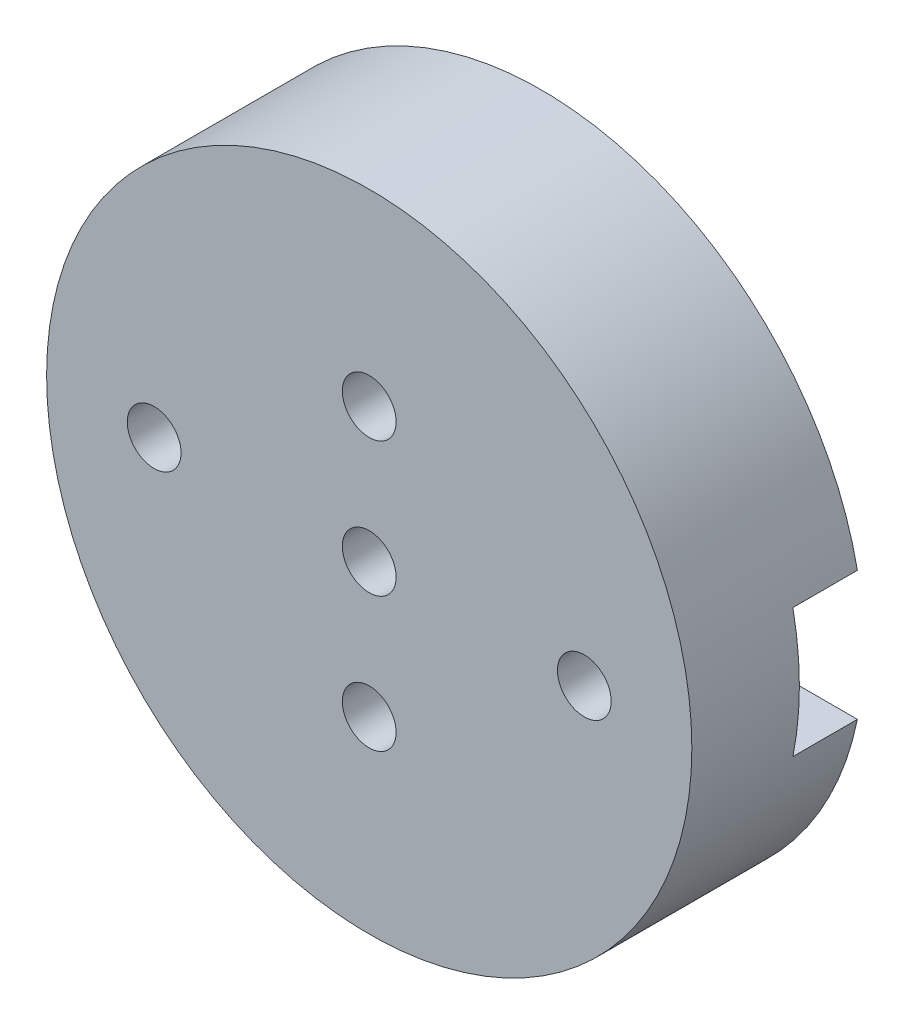
ISO-10303-21;
HEADER;
FILE_DESCRIPTION(('STEP AP214'),'2;1');
FILE_NAME('part.step','',(''),(''),'','','');
FILE_SCHEMA(('AUTOMOTIVE_DESIGN { 1 0 10303 214 1 1 1 1 }'));
ENDSEC;
DATA;
#1=APPLICATION_CONTEXT('core data for automotive mechanical design processes');
#2=APPLICATION_PROTOCOL_DEFINITION('international standard','automotive_design',2000,#1);
#3=PRODUCT_CONTEXT('',#1,'mechanical');
#4=PRODUCT('Part','Part','',(#3));
#5=PRODUCT_RELATED_PRODUCT_CATEGORY('part','',(#4));
#6=PRODUCT_DEFINITION_FORMATION('','',#4);
#7=PRODUCT_DEFINITION_CONTEXT('part definition',#1,'design');
#8=PRODUCT_DEFINITION('design','',#6,#7);
#9=PRODUCT_DEFINITION_SHAPE('','',#8);
#10=(LENGTH_UNIT() NAMED_UNIT(*) SI_UNIT(.MILLI.,.METRE.));
#11=(NAMED_UNIT(*) PLANE_ANGLE_UNIT() SI_UNIT($,.RADIAN.));
#12=(NAMED_UNIT(*) SI_UNIT($,.STERADIAN.) SOLID_ANGLE_UNIT());
#13=UNCERTAINTY_MEASURE_WITH_UNIT(LENGTH_MEASURE(1.E-05),#10,'distance_accuracy_value','');
#14=(GEOMETRIC_REPRESENTATION_CONTEXT(3) GLOBAL_UNCERTAINTY_ASSIGNED_CONTEXT((#13)) GLOBAL_UNIT_ASSIGNED_CONTEXT((#10,
#11,#12)) REPRESENTATION_CONTEXT('',''));
#15=CARTESIAN_POINT('',(0.,0.,0.));
#16=DIRECTION('',(0.,0.,1.));
#17=DIRECTION('',(1.,0.,0.));
#18=AXIS2_PLACEMENT_3D('',#15,#16,#17);
#19=CARTESIAN_POINT('',(0.,0.,0.));
#20=DIRECTION('',(0.,0.,1.));
#21=DIRECTION('',(1.,0.,0.));
#22=AXIS2_PLACEMENT_3D('',#19,#20,#21);
#23=PLANE('',#22);
#24=CARTESIAN_POINT('',(0.,6.52256026967279E-13,0.));
#25=DIRECTION('',(0.,0.,1.));
#26=DIRECTION('',(1.,0.,0.));
#27=AXIS2_PLACEMENT_3D('',#24,#25,#26);
#28=CIRCLE('',#27,43.1561541031372);
#29=CARTESIAN_POINT('',(21.6669859204082,-37.3228530273144,0.));
#30=VERTEX_POINT('',#29);
#31=CARTESIAN_POINT('',(-21.4890459031632,-37.4255867441704,0.));
#32=VERTEX_POINT('',#31);
#33=EDGE_CURVE('E221',#30,#32,#28,.F.);
#34=ORIENTED_EDGE('',*,*,#33,.T.);
#35=CARTESIAN_POINT('',(-24.476667902817,-42.6288659781905,0.));
#36=DIRECTION('',(0.,0.,1.));
#37=DIRECTION('',(1.,0.,0.));
#38=AXIS2_PLACEMENT_3D('',#35,#36,#37);
#39=CIRCLE('',#38,6.00000000000001);
#40=CARTESIAN_POINT('',(-27.4642899024707,-47.8321452122106,0.));
#41=VERTEX_POINT('',#40);
#42=EDGE_CURVE('E56',#41,#32,#39,.F.);
#43=ORIENTED_EDGE('',*,*,#42,.F.);
#44=CARTESIAN_POINT('',(0.,6.52256026967279E-13,0.));
#45=DIRECTION('',(0.,0.,1.));
#46=DIRECTION('',(1.,0.,0.));
#47=AXIS2_PLACEMENT_3D('',#44,#45,#46);
#48=CIRCLE('',#47,55.1561541031372);
#49=CARTESIAN_POINT('',(27.6917079200453,-47.7008453585453,0.));
#50=VERTEX_POINT('',#49);
#51=EDGE_CURVE('E235',#50,#41,#48,.F.);
#52=ORIENTED_EDGE('',*,*,#51,.F.);
#53=CARTESIAN_POINT('',(24.6793469202267,-42.5118491929299,0.));
#54=DIRECTION('',(0.,0.,1.));
#55=DIRECTION('',(1.,0.,0.));
#56=AXIS2_PLACEMENT_3D('',#53,#54,#55);
#57=CIRCLE('',#56,6.00000000000001);
#58=EDGE_CURVE('E239',#30,#50,#57,.F.);
#59=ORIENTED_EDGE('',*,*,#58,.F.);
#60=EDGE_LOOP('',(#34,#43,#52,#59));
#61=FACE_BOUND('',#60,.T.);
#62=DIRECTION('',(1.,0.,0.));
#63=VECTOR('',#62,1.);
#64=CARTESIAN_POINT('',(0.,-12.,0.));
#65=LINE('',#64,#63);
#66=CARTESIAN_POINT('',(12.0000000000004,-12.,0.));
#67=VERTEX_POINT('',#66);
#68=CARTESIAN_POINT('',(58.7877538267963,-12.,0.));
#69=VERTEX_POINT('',#68);
#70=EDGE_CURVE('E301',#67,#69,#65,.T.);
#71=ORIENTED_EDGE('',*,*,#70,.T.);
#72=CARTESIAN_POINT('',(0.,0.,0.));
#73=DIRECTION('',(0.,0.,1.));
#74=DIRECTION('',(1.,0.,0.));
#75=AXIS2_PLACEMENT_3D('',#72,#73,#74);
#76=CIRCLE('',#75,60.);
#77=CARTESIAN_POINT('',(-58.7877538267963,-12.,0.));
#78=VERTEX_POINT('',#77);
#79=EDGE_CURVE('E393',#78,#69,#76,.T.);
#80=ORIENTED_EDGE('',*,*,#79,.F.);
#81=DIRECTION('',(1.,0.,0.));
#82=VECTOR('',#81,1.);
#83=CARTESIAN_POINT('',(0.,-12.,0.));
#84=LINE('',#83,#82);
#85=CARTESIAN_POINT('',(-12.,-12.,0.));
#86=VERTEX_POINT('',#85);
#87=EDGE_CURVE('E262',#78,#86,#84,.T.);
#88=ORIENTED_EDGE('',*,*,#87,.T.);
#89=DIRECTION('',(0.,-1.,0.));
#90=VECTOR('',#89,1.);
#91=CARTESIAN_POINT('',(-12.,0.,0.));
#92=LINE('',#91,#90);
#93=CARTESIAN_POINT('',(-12.,-25.,0.));
#94=VERTEX_POINT('',#93);
#95=EDGE_CURVE('E203',#86,#94,#92,.T.);
#96=ORIENTED_EDGE('',*,*,#95,.T.);
#97=CARTESIAN_POINT('',(2.60330291914301E-13,-25.,0.));
#98=DIRECTION('',(0.,0.,1.));
#99=DIRECTION('',(1.,0.,0.));
#100=AXIS2_PLACEMENT_3D('',#97,#98,#99);
#101=CIRCLE('',#100,12.);
#102=CARTESIAN_POINT('',(12.,-25.,0.));
#103=VERTEX_POINT('',#102);
#104=EDGE_CURVE('E210',#94,#103,#101,.T.);
#105=ORIENTED_EDGE('',*,*,#104,.T.);
#106=DIRECTION('',(0.,-1.,0.));
#107=VECTOR('',#106,1.);
#108=CARTESIAN_POINT('',(12.0000000000007,-3.50681022682102E-13,0.));
#109=LINE('',#108,#107);
#110=EDGE_CURVE('E297',#67,#103,#109,.T.);
#111=ORIENTED_EDGE('',*,*,#110,.F.);
#112=EDGE_LOOP('',(#71,#80,#88,#96,#105,#111));
#113=FACE_BOUND('',#112,.T.);
#114=ADVANCED_FACE('F40',(#61,#113),#23,.F.);
#115=CARTESIAN_POINT('',(0.,0.,32.));
#116=DIRECTION('',(0.,0.,-1.));
#117=DIRECTION('',(-1.,0.,0.));
#118=AXIS2_PLACEMENT_3D('',#115,#116,#117);
#119=CYLINDRICAL_SURFACE('',#118,60.);
#120=CARTESIAN_POINT('',(0.,0.,32.));
#121=DIRECTION('',(0.,0.,1.));
#122=DIRECTION('',(1.,0.,0.));
#123=AXIS2_PLACEMENT_3D('',#120,#121,#122);
#124=CIRCLE('',#123,60.);
#125=CARTESIAN_POINT('',(60.,0.,32.));
#126=VERTEX_POINT('',#125);
#127=EDGE_CURVE('E394',#126,#126,#124,.T.);
#128=ORIENTED_EDGE('',*,*,#127,.F.);
#129=EDGE_LOOP('',(#128));
#130=FACE_BOUND('',#129,.T.);
#131=CARTESIAN_POINT('',(58.7877538267963,12.,0.));
#132=VERTEX_POINT('',#131);
#133=CARTESIAN_POINT('',(-58.7877538267963,12.,0.));
#134=VERTEX_POINT('',#133);
#135=EDGE_CURVE('E399',#132,#134,#76,.T.);
#136=ORIENTED_EDGE('',*,*,#135,.T.);
#137=DIRECTION('',(0.,0.,-1.));
#138=VECTOR('',#137,1.);
#139=CARTESIAN_POINT('',(-58.7877538267963,12.,32.));
#140=LINE('',#139,#138);
#141=CARTESIAN_POINT('',(-58.7877538267963,12.,12.));
#142=VERTEX_POINT('',#141);
#143=EDGE_CURVE('E11',#134,#142,#140,.F.);
#144=ORIENTED_EDGE('',*,*,#143,.T.);
#145=CARTESIAN_POINT('',(0.,0.,12.));
#146=DIRECTION('',(0.,0.,1.));
#147=DIRECTION('',(1.,0.,0.));
#148=AXIS2_PLACEMENT_3D('',#145,#146,#147);
#149=CIRCLE('',#148,60.);
#150=CARTESIAN_POINT('',(-58.7877538267963,-12.,12.));
#151=VERTEX_POINT('',#150);
#152=EDGE_CURVE('E372',#142,#151,#149,.T.);
#153=ORIENTED_EDGE('',*,*,#152,.T.);
#154=DIRECTION('',(0.,0.,-1.));
#155=VECTOR('',#154,1.);
#156=CARTESIAN_POINT('',(-58.7877538267963,-12.,32.));
#157=LINE('',#156,#155);
#158=EDGE_CURVE('E49',#78,#151,#157,.F.);
#159=ORIENTED_EDGE('',*,*,#158,.F.);
#160=ORIENTED_EDGE('',*,*,#79,.T.);
#161=DIRECTION('',(0.,0.,-1.));
#162=VECTOR('',#161,1.);
#163=CARTESIAN_POINT('',(58.7877538267963,-12.,32.));
#164=LINE('',#163,#162);
#165=CARTESIAN_POINT('',(58.7877538267963,-12.,12.));
#166=VERTEX_POINT('',#165);
#167=EDGE_CURVE('E409',#166,#69,#164,.T.);
#168=ORIENTED_EDGE('',*,*,#167,.F.);
#169=CARTESIAN_POINT('',(58.7877538267963,12.,12.));
#170=VERTEX_POINT('',#169);
#171=EDGE_CURVE('E368',#166,#170,#149,.T.);
#172=ORIENTED_EDGE('',*,*,#171,.T.);
#173=DIRECTION('',(0.,0.,-1.));
#174=VECTOR('',#173,1.);
#175=CARTESIAN_POINT('',(58.7877538267963,12.,32.));
#176=LINE('',#175,#174);
#177=EDGE_CURVE('E398',#170,#132,#176,.T.);
#178=ORIENTED_EDGE('',*,*,#177,.T.);
#179=EDGE_LOOP('',(#136,#144,#153,#159,#160,#168,#172,#178));
#180=FACE_BOUND('',#179,.T.);
#181=ADVANCED_FACE('F42',(#130,#180),#119,.T.);
#182=CARTESIAN_POINT('',(0.,0.,32.));
#183=DIRECTION('',(0.,0.,1.));
#184=DIRECTION('',(1.,0.,0.));
#185=AXIS2_PLACEMENT_3D('',#182,#183,#184);
#186=PLANE('',#185);
#187=CARTESIAN_POINT('',(0.,25.,32.));
#188=DIRECTION('',(0.,0.,1.));
#189=DIRECTION('',(1.,0.,0.));
#190=AXIS2_PLACEMENT_3D('',#187,#188,#189);
#191=CIRCLE('',#190,5.);
#192=CARTESIAN_POINT('',(4.99999999999991,25.,32.));
#193=VERTEX_POINT('',#192);
#194=EDGE_CURVE('E377',#193,#193,#191,.T.);
#195=ORIENTED_EDGE('',*,*,#194,.F.);
#196=EDGE_LOOP('',(#195));
#197=FACE_BOUND('',#196,.T.);
#198=CARTESIAN_POINT('',(40.,0.,32.));
#199=DIRECTION('',(0.,0.,1.));
#200=DIRECTION('',(1.,0.,0.));
#201=AXIS2_PLACEMENT_3D('',#198,#199,#200);
#202=CIRCLE('',#201,5.);
#203=CARTESIAN_POINT('',(45.,0.,32.));
#204=VERTEX_POINT('',#203);
#205=EDGE_CURVE('E385',#204,#204,#202,.T.);
#206=ORIENTED_EDGE('',*,*,#205,.F.);
#207=EDGE_LOOP('',(#206));
#208=FACE_BOUND('',#207,.T.);
#209=ORIENTED_EDGE('',*,*,#127,.T.);
#210=EDGE_LOOP('',(#209));
#211=FACE_BOUND('',#210,.T.);
#212=CARTESIAN_POINT('',(0.,0.,32.));
#213=DIRECTION('',(0.,0.,1.));
#214=DIRECTION('',(1.,0.,0.));
#215=AXIS2_PLACEMENT_3D('',#212,#213,#214);
#216=CIRCLE('',#215,5.);
#217=CARTESIAN_POINT('',(5.,0.,32.));
#218=VERTEX_POINT('',#217);
#219=EDGE_CURVE('E389',#218,#218,#216,.T.);
#220=ORIENTED_EDGE('',*,*,#219,.F.);
#221=EDGE_LOOP('',(#220));
#222=FACE_BOUND('',#221,.T.);
#223=CARTESIAN_POINT('',(-40.,-2.79318507107451E-13,32.));
#224=DIRECTION('',(0.,0.,1.));
#225=DIRECTION('',(1.,0.,0.));
#226=AXIS2_PLACEMENT_3D('',#223,#224,#225);
#227=CIRCLE('',#226,5.);
#228=CARTESIAN_POINT('',(-35.,-2.79318507107451E-13,32.));
#229=VERTEX_POINT('',#228);
#230=EDGE_CURVE('E381',#229,#229,#227,.T.);
#231=ORIENTED_EDGE('',*,*,#230,.F.);
#232=EDGE_LOOP('',(#231));
#233=FACE_BOUND('',#232,.T.);
#234=CARTESIAN_POINT('',(2.60330291914301E-13,-25.,32.));
#235=DIRECTION('',(0.,0.,1.));
#236=DIRECTION('',(1.,0.,0.));
#237=AXIS2_PLACEMENT_3D('',#234,#235,#236);
#238=CIRCLE('',#237,5.);
#239=CARTESIAN_POINT('',(5.00000000000026,-25.,32.));
#240=VERTEX_POINT('',#239);
#241=EDGE_CURVE('E373',#240,#240,#238,.T.);
#242=ORIENTED_EDGE('',*,*,#241,.F.);
#243=EDGE_LOOP('',(#242));
#244=FACE_BOUND('',#243,.T.);
#245=ADVANCED_FACE('F506',(#197,#208,#211,#222,#233,#244),#186,.T.);
#246=CARTESIAN_POINT('',(0.,6.52256026967279E-13,0.));
#247=DIRECTION('',(0.,0.,1.));
#248=DIRECTION('',(1.,0.,0.));
#249=AXIS2_PLACEMENT_3D('',#246,#247,#248);
#250=CIRCLE('',#249,54.9999999999994);
#251=CARTESIAN_POINT('',(27.6133091650036,47.5657981848085,0.));
#252=VERTEX_POINT('',#251);
#253=CARTESIAN_POINT('',(-27.3865349968262,47.6967263118509,0.));
#254=VERTEX_POINT('',#253);
#255=EDGE_CURVE('E64',#252,#254,#250,.T.);
#256=ORIENTED_EDGE('',*,*,#255,.T.);
#257=CARTESIAN_POINT('',(-24.3989129971725,42.4934470778308,0.));
#258=DIRECTION('',(0.,0.,1.));
#259=DIRECTION('',(1.,0.,0.));
#260=AXIS2_PLACEMENT_3D('',#257,#258,#259);
#261=CIRCLE('',#260,6.);
#262=CARTESIAN_POINT('',(-21.4112909975187,37.2901678438107,0.));
#263=VERTEX_POINT('',#262);
#264=EDGE_CURVE('E201',#254,#263,#261,.T.);
#265=ORIENTED_EDGE('',*,*,#264,.T.);
#266=CARTESIAN_POINT('',(0.,6.52256026967279E-13,0.));
#267=DIRECTION('',(0.,0.,1.));
#268=DIRECTION('',(1.,0.,0.));
#269=AXIS2_PLACEMENT_3D('',#266,#267,#268);
#270=CIRCLE('',#269,42.9999999999994);
#271=CARTESIAN_POINT('',(21.5885871653664,37.1878058535776,0.));
#272=VERTEX_POINT('',#271);
#273=EDGE_CURVE('E876',#272,#263,#270,.T.);
#274=ORIENTED_EDGE('',*,*,#273,.F.);
#275=CARTESIAN_POINT('',(24.600948165185,42.376802019193,0.));
#276=DIRECTION('',(0.,0.,1.));
#277=DIRECTION('',(1.,0.,0.));
#278=AXIS2_PLACEMENT_3D('',#275,#276,#277);
#279=CIRCLE('',#278,6.);
#280=EDGE_CURVE('E197',#272,#252,#279,.T.);
#281=ORIENTED_EDGE('',*,*,#280,.T.);
#282=EDGE_LOOP('',(#256,#265,#274,#281));
#283=FACE_BOUND('',#282,.T.);
#284=ORIENTED_EDGE('',*,*,#135,.F.);
#285=DIRECTION('',(1.,0.,0.));
#286=VECTOR('',#285,1.);
#287=CARTESIAN_POINT('',(0.,12.,0.));
#288=LINE('',#287,#286);
#289=CARTESIAN_POINT('',(12.0000000000001,12.,0.));
#290=VERTEX_POINT('',#289);
#291=EDGE_CURVE('E305',#290,#132,#288,.T.);
#292=ORIENTED_EDGE('',*,*,#291,.F.);
#293=DIRECTION('',(0.,-1.,0.));
#294=VECTOR('',#293,1.);
#295=CARTESIAN_POINT('',(12.0000000000003,1.24900090270333E-13,0.));
#296=LINE('',#295,#294);
#297=CARTESIAN_POINT('',(12.,25.,0.));
#298=VERTEX_POINT('',#297);
#299=EDGE_CURVE('E308',#298,#290,#296,.T.);
#300=ORIENTED_EDGE('',*,*,#299,.F.);
#301=CARTESIAN_POINT('',(0.,25.,0.));
#302=DIRECTION('',(0.,0.,1.));
#303=DIRECTION('',(1.,0.,0.));
#304=AXIS2_PLACEMENT_3D('',#301,#302,#303);
#305=CIRCLE('',#304,12.);
#306=CARTESIAN_POINT('',(-12.,24.9999999999999,0.));
#307=VERTEX_POINT('',#306);
#308=EDGE_CURVE('E312',#298,#307,#305,.T.);
#309=ORIENTED_EDGE('',*,*,#308,.T.);
#310=DIRECTION('',(0.,-1.,0.));
#311=VECTOR('',#310,1.);
#312=CARTESIAN_POINT('',(-12.,0.,0.));
#313=LINE('',#312,#311);
#314=CARTESIAN_POINT('',(-12.,12.,0.));
#315=VERTEX_POINT('',#314);
#316=EDGE_CURVE('E316',#307,#315,#313,.T.);
#317=ORIENTED_EDGE('',*,*,#316,.T.);
#318=DIRECTION('',(1.,0.,0.));
#319=VECTOR('',#318,1.);
#320=CARTESIAN_POINT('',(0.,12.,0.));
#321=LINE('',#320,#319);
#322=EDGE_CURVE('E320',#134,#315,#321,.T.);
#323=ORIENTED_EDGE('',*,*,#322,.F.);
#324=EDGE_LOOP('',(#284,#292,#300,#309,#317,#323));
#325=FACE_BOUND('',#324,.T.);
#326=ADVANCED_FACE('F502',(#283,#325),#23,.F.);
#327=CARTESIAN_POINT('',(0.,0.,32.));
#328=DIRECTION('',(0.,0.,-1.));
#329=DIRECTION('',(-1.,0.,0.));
#330=AXIS2_PLACEMENT_3D('',#327,#328,#329);
#331=CYLINDRICAL_SURFACE('',#330,5.);
#332=CARTESIAN_POINT('',(0.,0.,12.));
#333=DIRECTION('',(0.,0.,1.));
#334=DIRECTION('',(1.,0.,0.));
#335=AXIS2_PLACEMENT_3D('',#332,#333,#334);
#336=CIRCLE('',#335,5.);
#337=CARTESIAN_POINT('',(5.,0.,12.));
#338=VERTEX_POINT('',#337);
#339=EDGE_CURVE('E364',#338,#338,#336,.T.);
#340=ORIENTED_EDGE('',*,*,#339,.F.);
#341=EDGE_LOOP('',(#340));
#342=FACE_BOUND('',#341,.T.);
#343=ORIENTED_EDGE('',*,*,#219,.T.);
#344=EDGE_LOOP('',(#343));
#345=FACE_BOUND('',#344,.T.);
#346=ADVANCED_FACE('F510',(#342,#345),#331,.F.);
#347=CARTESIAN_POINT('',(40.,0.,32.));
#348=DIRECTION('',(0.,0.,-1.));
#349=DIRECTION('',(-1.,0.,0.));
#350=AXIS2_PLACEMENT_3D('',#347,#348,#349);
#351=CYLINDRICAL_SURFACE('',#350,5.);
#352=CARTESIAN_POINT('',(40.,0.,12.));
#353=DIRECTION('',(0.,0.,1.));
#354=DIRECTION('',(1.,0.,0.));
#355=AXIS2_PLACEMENT_3D('',#352,#353,#354);
#356=CIRCLE('',#355,5.);
#357=CARTESIAN_POINT('',(45.,0.,12.));
#358=VERTEX_POINT('',#357);
#359=EDGE_CURVE('E360',#358,#358,#356,.T.);
#360=ORIENTED_EDGE('',*,*,#359,.F.);
#361=EDGE_LOOP('',(#360));
#362=FACE_BOUND('',#361,.T.);
#363=ORIENTED_EDGE('',*,*,#205,.T.);
#364=EDGE_LOOP('',(#363));
#365=FACE_BOUND('',#364,.T.);
#366=ADVANCED_FACE('F516',(#362,#365),#351,.F.);
#367=CARTESIAN_POINT('',(-40.,-2.79318507107451E-13,32.));
#368=DIRECTION('',(0.,0.,-1.));
#369=DIRECTION('',(-1.,0.,0.));
#370=AXIS2_PLACEMENT_3D('',#367,#368,#369);
#371=CYLINDRICAL_SURFACE('',#370,5.);
#372=CARTESIAN_POINT('',(-40.,-2.79318507107451E-13,12.));
#373=DIRECTION('',(0.,0.,1.));
#374=DIRECTION('',(1.,0.,0.));
#375=AXIS2_PLACEMENT_3D('',#372,#373,#374);
#376=CIRCLE('',#375,5.);
#377=CARTESIAN_POINT('',(-35.,-2.79318507107451E-13,12.));
#378=VERTEX_POINT('',#377);
#379=EDGE_CURVE('E356',#378,#378,#376,.T.);
#380=ORIENTED_EDGE('',*,*,#379,.F.);
#381=EDGE_LOOP('',(#380));
#382=FACE_BOUND('',#381,.T.);
#383=ORIENTED_EDGE('',*,*,#230,.T.);
#384=EDGE_LOOP('',(#383));
#385=FACE_BOUND('',#384,.T.);
#386=ADVANCED_FACE('F791',(#382,#385),#371,.F.);
#387=CARTESIAN_POINT('',(0.,25.,32.));
#388=DIRECTION('',(0.,0.,-1.));
#389=DIRECTION('',(-1.,0.,0.));
#390=AXIS2_PLACEMENT_3D('',#387,#388,#389);
#391=CYLINDRICAL_SURFACE('',#390,5.);
#392=CARTESIAN_POINT('',(0.,25.,12.));
#393=DIRECTION('',(0.,0.,1.));
#394=DIRECTION('',(1.,0.,0.));
#395=AXIS2_PLACEMENT_3D('',#392,#393,#394);
#396=CIRCLE('',#395,5.);
#397=CARTESIAN_POINT('',(4.99999999999991,25.,12.));
#398=VERTEX_POINT('',#397);
#399=EDGE_CURVE('E352',#398,#398,#396,.T.);
#400=ORIENTED_EDGE('',*,*,#399,.F.);
#401=EDGE_LOOP('',(#400));
#402=FACE_BOUND('',#401,.T.);
#403=ORIENTED_EDGE('',*,*,#194,.T.);
#404=EDGE_LOOP('',(#403));
#405=FACE_BOUND('',#404,.T.);
#406=ADVANCED_FACE('F781',(#402,#405),#391,.F.);
#407=CARTESIAN_POINT('',(2.60330291914301E-13,-25.,32.));
#408=DIRECTION('',(0.,0.,-1.));
#409=DIRECTION('',(-1.,0.,0.));
#410=AXIS2_PLACEMENT_3D('',#407,#408,#409);
#411=CYLINDRICAL_SURFACE('',#410,5.);
#412=CARTESIAN_POINT('',(2.60330291914301E-13,-25.,12.));
#413=DIRECTION('',(0.,0.,1.));
#414=DIRECTION('',(1.,0.,0.));
#415=AXIS2_PLACEMENT_3D('',#412,#413,#414);
#416=CIRCLE('',#415,5.);
#417=CARTESIAN_POINT('',(5.00000000000026,-25.,12.));
#418=VERTEX_POINT('',#417);
#419=EDGE_CURVE('E351',#418,#418,#416,.T.);
#420=ORIENTED_EDGE('',*,*,#419,.F.);
#421=EDGE_LOOP('',(#420));
#422=FACE_BOUND('',#421,.T.);
#423=ORIENTED_EDGE('',*,*,#241,.T.);
#424=EDGE_LOOP('',(#423));
#425=FACE_BOUND('',#424,.T.);
#426=ADVANCED_FACE('F562',(#422,#425),#411,.F.);
#427=CARTESIAN_POINT('',(0.,-12.,12.));
#428=DIRECTION('',(0.,1.,0.));
#429=DIRECTION('',(-1.,0.,0.));
#430=AXIS2_PLACEMENT_3D('',#427,#428,#429);
#431=PLANE('',#430);
#432=ORIENTED_EDGE('',*,*,#167,.T.);
#433=ORIENTED_EDGE('',*,*,#70,.F.);
#434=DIRECTION('',(0.,0.,-1.));
#435=VECTOR('',#434,1.);
#436=CARTESIAN_POINT('',(12.0000000000004,-12.,12.));
#437=LINE('',#436,#435);
#438=CARTESIAN_POINT('',(12.0000000000004,-12.,12.));
#439=VERTEX_POINT('',#438);
#440=EDGE_CURVE('E341',#439,#67,#437,.T.);
#441=ORIENTED_EDGE('',*,*,#440,.F.);
#442=DIRECTION('',(1.,0.,0.));
#443=VECTOR('',#442,1.);
#444=CARTESIAN_POINT('',(0.,-12.,12.));
#445=LINE('',#444,#443);
#446=EDGE_CURVE('E269',#439,#166,#445,.T.);
#447=ORIENTED_EDGE('',*,*,#446,.T.);
#448=EDGE_LOOP('',(#432,#433,#441,#447));
#449=FACE_BOUND('',#448,.T.);
#450=ADVANCED_FACE('F478',(#449),#431,.T.);
#451=CARTESIAN_POINT('',(0.,12.,12.));
#452=DIRECTION('',(0.,1.,0.));
#453=DIRECTION('',(-1.,0.,0.));
#454=AXIS2_PLACEMENT_3D('',#451,#452,#453);
#455=PLANE('',#454);
#456=DIRECTION('',(1.,0.,0.));
#457=VECTOR('',#456,1.);
#458=CARTESIAN_POINT('',(0.,12.,12.));
#459=LINE('',#458,#457);
#460=CARTESIAN_POINT('',(12.0000000000001,12.,12.));
#461=VERTEX_POINT('',#460);
#462=EDGE_CURVE('E273',#461,#170,#459,.T.);
#463=ORIENTED_EDGE('',*,*,#462,.F.);
#464=DIRECTION('',(0.,0.,-1.));
#465=VECTOR('',#464,1.);
#466=CARTESIAN_POINT('',(12.0000000000001,12.,12.));
#467=LINE('',#466,#465);
#468=EDGE_CURVE('E338',#461,#290,#467,.T.);
#469=ORIENTED_EDGE('',*,*,#468,.T.);
#470=ORIENTED_EDGE('',*,*,#291,.T.);
#471=ORIENTED_EDGE('',*,*,#177,.F.);
#472=EDGE_LOOP('',(#463,#469,#470,#471));
#473=FACE_BOUND('',#472,.T.);
#474=ADVANCED_FACE('F529',(#473),#455,.F.);
#475=CARTESIAN_POINT('',(0.,12.,12.));
#476=DIRECTION('',(0.,1.,0.));
#477=DIRECTION('',(0.,0.,1.));
#478=AXIS2_PLACEMENT_3D('',#475,#476,#477);
#479=PLANE('',#478);
#480=ORIENTED_EDGE('',*,*,#322,.T.);
#481=DIRECTION('',(0.,0.,-1.));
#482=VECTOR('',#481,1.);
#483=CARTESIAN_POINT('',(-12.,12.,12.));
#484=LINE('',#483,#482);
#485=CARTESIAN_POINT('',(-12.,12.,12.));
#486=VERTEX_POINT('',#485);
#487=EDGE_CURVE('E328',#486,#315,#484,.T.);
#488=ORIENTED_EDGE('',*,*,#487,.F.);
#489=DIRECTION('',(1.,0.,0.));
#490=VECTOR('',#489,1.);
#491=CARTESIAN_POINT('',(0.,12.,12.));
#492=LINE('',#491,#490);
#493=EDGE_CURVE('E287',#142,#486,#492,.T.);
#494=ORIENTED_EDGE('',*,*,#493,.F.);
#495=ORIENTED_EDGE('',*,*,#143,.F.);
#496=EDGE_LOOP('',(#480,#488,#494,#495));
#497=FACE_BOUND('',#496,.T.);
#498=ADVANCED_FACE('F544',(#497),#479,.F.);
#499=CARTESIAN_POINT('',(0.,-12.,12.));
#500=DIRECTION('',(0.,1.,0.));
#501=DIRECTION('',(0.,0.,1.));
#502=AXIS2_PLACEMENT_3D('',#499,#500,#501);
#503=PLANE('',#502);
#504=ORIENTED_EDGE('',*,*,#158,.T.);
#505=DIRECTION('',(1.,0.,0.));
#506=VECTOR('',#505,1.);
#507=CARTESIAN_POINT('',(0.,-12.,12.));
#508=LINE('',#507,#506);
#509=CARTESIAN_POINT('',(-12.,-12.,12.));
#510=VERTEX_POINT('',#509);
#511=EDGE_CURVE('E290',#151,#510,#508,.T.);
#512=ORIENTED_EDGE('',*,*,#511,.T.);
#513=DIRECTION('',(0.,0.,-1.));
#514=VECTOR('',#513,1.);
#515=CARTESIAN_POINT('',(-12.,-12.,12.));
#516=LINE('',#515,#514);
#517=EDGE_CURVE('E292',#510,#86,#516,.T.);
#518=ORIENTED_EDGE('',*,*,#517,.T.);
#519=ORIENTED_EDGE('',*,*,#87,.F.);
#520=EDGE_LOOP('',(#504,#512,#518,#519));
#521=FACE_BOUND('',#520,.T.);
#522=ADVANCED_FACE('F416',(#521),#503,.T.);
#523=CARTESIAN_POINT('',(0.,0.,12.));
#524=DIRECTION('',(0.,0.,1.));
#525=DIRECTION('',(1.,0.,0.));
#526=AXIS2_PLACEMENT_3D('',#523,#524,#525);
#527=PLANE('',#526);
#528=ORIENTED_EDGE('',*,*,#339,.T.);
#529=EDGE_LOOP('',(#528));
#530=FACE_BOUND('',#529,.T.);
#531=ORIENTED_EDGE('',*,*,#359,.T.);
#532=EDGE_LOOP('',(#531));
#533=FACE_BOUND('',#532,.T.);
#534=ORIENTED_EDGE('',*,*,#379,.T.);
#535=EDGE_LOOP('',(#534));
#536=FACE_BOUND('',#535,.T.);
#537=ORIENTED_EDGE('',*,*,#399,.T.);
#538=EDGE_LOOP('',(#537));
#539=FACE_BOUND('',#538,.T.);
#540=ORIENTED_EDGE('',*,*,#419,.T.);
#541=EDGE_LOOP('',(#540));
#542=FACE_BOUND('',#541,.T.);
#543=ORIENTED_EDGE('',*,*,#493,.T.);
#544=DIRECTION('',(0.,-1.,0.));
#545=VECTOR('',#544,1.);
#546=CARTESIAN_POINT('',(-12.,0.,12.));
#547=LINE('',#546,#545);
#548=CARTESIAN_POINT('',(-12.,24.9999999999999,12.));
#549=VERTEX_POINT('',#548);
#550=EDGE_CURVE('E283',#549,#486,#547,.T.);
#551=ORIENTED_EDGE('',*,*,#550,.F.);
#552=CARTESIAN_POINT('',(0.,25.,12.));
#553=DIRECTION('',(0.,0.,1.));
#554=DIRECTION('',(1.,0.,0.));
#555=AXIS2_PLACEMENT_3D('',#552,#553,#554);
#556=CIRCLE('',#555,12.);
#557=CARTESIAN_POINT('',(12.,25.,12.));
#558=VERTEX_POINT('',#557);
#559=EDGE_CURVE('E280',#558,#549,#556,.T.);
#560=ORIENTED_EDGE('',*,*,#559,.F.);
#561=DIRECTION('',(0.,-1.,0.));
#562=VECTOR('',#561,1.);
#563=CARTESIAN_POINT('',(12.0000000000003,1.24900090270333E-13,12.));
#564=LINE('',#563,#562);
#565=EDGE_CURVE('E276',#558,#461,#564,.T.);
#566=ORIENTED_EDGE('',*,*,#565,.T.);
#567=ORIENTED_EDGE('',*,*,#462,.T.);
#568=ORIENTED_EDGE('',*,*,#171,.F.);
#569=ORIENTED_EDGE('',*,*,#446,.F.);
#570=DIRECTION('',(0.,-1.,0.));
#571=VECTOR('',#570,1.);
#572=CARTESIAN_POINT('',(12.0000000000007,-3.50681022682102E-13,12.));
#573=LINE('',#572,#571);
#574=CARTESIAN_POINT('',(12.,-25.,12.));
#575=VERTEX_POINT('',#574);
#576=EDGE_CURVE('E265',#439,#575,#573,.T.);
#577=ORIENTED_EDGE('',*,*,#576,.T.);
#578=CARTESIAN_POINT('',(2.60330291914301E-13,-25.,12.));
#579=DIRECTION('',(0.,0.,1.));
#580=DIRECTION('',(1.,0.,0.));
#581=AXIS2_PLACEMENT_3D('',#578,#579,#580);
#582=CIRCLE('',#581,12.);
#583=CARTESIAN_POINT('',(-12.,-25.,12.));
#584=VERTEX_POINT('',#583);
#585=EDGE_CURVE('E261',#584,#575,#582,.T.);
#586=ORIENTED_EDGE('',*,*,#585,.F.);
#587=DIRECTION('',(0.,-1.,0.));
#588=VECTOR('',#587,1.);
#589=CARTESIAN_POINT('',(-12.,0.,12.));
#590=LINE('',#589,#588);
#591=EDGE_CURVE('E257',#510,#584,#590,.T.);
#592=ORIENTED_EDGE('',*,*,#591,.F.);
#593=ORIENTED_EDGE('',*,*,#511,.F.);
#594=ORIENTED_EDGE('',*,*,#152,.F.);
#595=EDGE_LOOP('',(#543,#551,#560,#566,#567,#568,#569,#577,#586,#592,#593,#594));
#596=FACE_BOUND('',#595,.T.);
#597=ADVANCED_FACE('F424',(#530,#533,#536,#539,#542,#596),#527,.F.);
#598=CARTESIAN_POINT('',(-12.,0.,12.));
#599=DIRECTION('',(1.,0.,0.));
#600=DIRECTION('',(0.,1.,0.));
#601=AXIS2_PLACEMENT_3D('',#598,#599,#600);
#602=PLANE('',#601);
#603=ORIENTED_EDGE('',*,*,#95,.F.);
#604=ORIENTED_EDGE('',*,*,#517,.F.);
#605=ORIENTED_EDGE('',*,*,#591,.T.);
#606=DIRECTION('',(0.,0.,-1.));
#607=VECTOR('',#606,1.);
#608=CARTESIAN_POINT('',(-12.,-25.,12.));
#609=LINE('',#608,#607);
#610=EDGE_CURVE('E347',#584,#94,#609,.T.);
#611=ORIENTED_EDGE('',*,*,#610,.T.);
#612=EDGE_LOOP('',(#603,#604,#605,#611));
#613=FACE_BOUND('',#612,.T.);
#614=ADVANCED_FACE('F489',(#613),#602,.T.);
#615=CARTESIAN_POINT('',(2.60330291914301E-13,-25.,12.));
#616=DIRECTION('',(0.,0.,-1.));
#617=DIRECTION('',(-1.,0.,0.));
#618=AXIS2_PLACEMENT_3D('',#615,#616,#617);
#619=CYLINDRICAL_SURFACE('',#618,12.);
#620=ORIENTED_EDGE('',*,*,#104,.F.);
#621=ORIENTED_EDGE('',*,*,#610,.F.);
#622=ORIENTED_EDGE('',*,*,#585,.T.);
#623=DIRECTION('',(0.,0.,-1.));
#624=VECTOR('',#623,1.);
#625=CARTESIAN_POINT('',(12.,-25.,12.));
#626=LINE('',#625,#624);
#627=EDGE_CURVE('E344',#575,#103,#626,.T.);
#628=ORIENTED_EDGE('',*,*,#627,.T.);
#629=EDGE_LOOP('',(#620,#621,#622,#628));
#630=FACE_BOUND('',#629,.T.);
#631=ADVANCED_FACE('F485',(#630),#619,.F.);
#632=CARTESIAN_POINT('',(12.0000000000007,-3.50681022682102E-13,12.));
#633=DIRECTION('',(1.,0.,0.));
#634=DIRECTION('',(0.,1.,0.));
#635=AXIS2_PLACEMENT_3D('',#632,#633,#634);
#636=PLANE('',#635);
#637=ORIENTED_EDGE('',*,*,#110,.T.);
#638=ORIENTED_EDGE('',*,*,#627,.F.);
#639=ORIENTED_EDGE('',*,*,#576,.F.);
#640=ORIENTED_EDGE('',*,*,#440,.T.);
#641=EDGE_LOOP('',(#637,#638,#639,#640));
#642=FACE_BOUND('',#641,.T.);
#643=ADVANCED_FACE('F483',(#642),#636,.F.);
#644=CARTESIAN_POINT('',(12.0000000000003,1.24900090270333E-13,12.));
#645=DIRECTION('',(1.,0.,0.));
#646=DIRECTION('',(0.,1.,0.));
#647=AXIS2_PLACEMENT_3D('',#644,#645,#646);
#648=PLANE('',#647);
#649=ORIENTED_EDGE('',*,*,#299,.T.);
#650=ORIENTED_EDGE('',*,*,#468,.F.);
#651=ORIENTED_EDGE('',*,*,#565,.F.);
#652=DIRECTION('',(0.,0.,-1.));
#653=VECTOR('',#652,1.);
#654=CARTESIAN_POINT('',(12.,25.,12.));
#655=LINE('',#654,#653);
#656=EDGE_CURVE('E335',#558,#298,#655,.T.);
#657=ORIENTED_EDGE('',*,*,#656,.T.);
#658=EDGE_LOOP('',(#649,#650,#651,#657));
#659=FACE_BOUND('',#658,.T.);
#660=ADVANCED_FACE('F532',(#659),#648,.F.);
#661=CARTESIAN_POINT('',(0.,25.,12.));
#662=DIRECTION('',(0.,0.,-1.));
#663=DIRECTION('',(-1.,0.,0.));
#664=AXIS2_PLACEMENT_3D('',#661,#662,#663);
#665=CYLINDRICAL_SURFACE('',#664,12.);
#666=ORIENTED_EDGE('',*,*,#308,.F.);
#667=ORIENTED_EDGE('',*,*,#656,.F.);
#668=ORIENTED_EDGE('',*,*,#559,.T.);
#669=DIRECTION('',(0.,0.,-1.));
#670=VECTOR('',#669,1.);
#671=CARTESIAN_POINT('',(-12.,24.9999999999999,12.));
#672=LINE('',#671,#670);
#673=EDGE_CURVE('E332',#549,#307,#672,.T.);
#674=ORIENTED_EDGE('',*,*,#673,.T.);
#675=EDGE_LOOP('',(#666,#667,#668,#674));
#676=FACE_BOUND('',#675,.T.);
#677=ADVANCED_FACE('F536',(#676),#665,.F.);
#678=CARTESIAN_POINT('',(-12.,0.,12.));
#679=DIRECTION('',(1.,0.,0.));
#680=DIRECTION('',(0.,1.,0.));
#681=AXIS2_PLACEMENT_3D('',#678,#679,#680);
#682=PLANE('',#681);
#683=ORIENTED_EDGE('',*,*,#316,.F.);
#684=ORIENTED_EDGE('',*,*,#673,.F.);
#685=ORIENTED_EDGE('',*,*,#550,.T.);
#686=ORIENTED_EDGE('',*,*,#487,.T.);
#687=EDGE_LOOP('',(#683,#684,#685,#686));
#688=FACE_BOUND('',#687,.T.);
#689=ADVANCED_FACE('F541',(#688),#682,.T.);
#690=CARTESIAN_POINT('',(0.,6.52256026967279E-13,12.));
#691=DIRECTION('',(0.,0.,-1.));
#692=DIRECTION('',(-1.,0.,0.));
#693=AXIS2_PLACEMENT_3D('',#690,#691,#692);
#694=CYLINDRICAL_SURFACE('',#693,54.9999999999994);
#695=ORIENTED_EDGE('',*,*,#255,.F.);
#696=DIRECTION('',(0.,0.,-1.));
#697=VECTOR('',#696,1.);
#698=CARTESIAN_POINT('',(27.6133091650036,47.5657981848085,12.));
#699=LINE('',#698,#697);
#700=CARTESIAN_POINT('',(27.6133091650036,47.5657981848085,12.));
#701=VERTEX_POINT('',#700);
#702=EDGE_CURVE('E195',#701,#252,#699,.T.);
#703=ORIENTED_EDGE('',*,*,#702,.F.);
#704=CARTESIAN_POINT('',(0.,6.52256026967279E-13,12.));
#705=DIRECTION('',(0.,0.,1.));
#706=DIRECTION('',(1.,0.,0.));
#707=AXIS2_PLACEMENT_3D('',#704,#705,#706);
#708=CIRCLE('',#707,54.9999999999994);
#709=CARTESIAN_POINT('',(-27.3865349968262,47.6967263118509,12.));
#710=VERTEX_POINT('',#709);
#711=EDGE_CURVE('E185',#701,#710,#708,.T.);
#712=ORIENTED_EDGE('',*,*,#711,.T.);
#713=DIRECTION('',(0.,0.,-1.));
#714=VECTOR('',#713,1.);
#715=CARTESIAN_POINT('',(-27.3865349968262,47.6967263118509,12.));
#716=LINE('',#715,#714);
#717=EDGE_CURVE('E194',#710,#254,#716,.T.);
#718=ORIENTED_EDGE('',*,*,#717,.T.);
#719=EDGE_LOOP('',(#695,#703,#712,#718));
#720=FACE_BOUND('',#719,.T.);
#721=ADVANCED_FACE('F193',(#720),#694,.F.);
#722=CARTESIAN_POINT('',(-24.3989129971725,42.4934470778308,12.));
#723=DIRECTION('',(0.,0.,-1.));
#724=DIRECTION('',(-1.,0.,0.));
#725=AXIS2_PLACEMENT_3D('',#722,#723,#724);
#726=CYLINDRICAL_SURFACE('',#725,6.);
#727=ORIENTED_EDGE('',*,*,#264,.F.);
#728=ORIENTED_EDGE('',*,*,#717,.F.);
#729=CARTESIAN_POINT('',(-24.3989129971725,42.4934470778308,12.));
#730=DIRECTION('',(0.,0.,1.));
#731=DIRECTION('',(1.,0.,0.));
#732=AXIS2_PLACEMENT_3D('',#729,#730,#731);
#733=CIRCLE('',#732,6.);
#734=CARTESIAN_POINT('',(-21.4112909975187,37.2901678438107,12.));
#735=VERTEX_POINT('',#734);
#736=EDGE_CURVE('E181',#710,#735,#733,.T.);
#737=ORIENTED_EDGE('',*,*,#736,.T.);
#738=DIRECTION('',(0.,0.,-1.));
#739=VECTOR('',#738,1.);
#740=CARTESIAN_POINT('',(-21.4112909975187,37.2901678438107,12.));
#741=LINE('',#740,#739);
#742=EDGE_CURVE('E204',#735,#263,#741,.T.);
#743=ORIENTED_EDGE('',*,*,#742,.T.);
#744=EDGE_LOOP('',(#727,#728,#737,#743));
#745=FACE_BOUND('',#744,.T.);
#746=ADVANCED_FACE('F199',(#745),#726,.F.);
#747=CARTESIAN_POINT('',(0.,6.52256026967279E-13,12.));
#748=DIRECTION('',(0.,0.,-1.));
#749=DIRECTION('',(-1.,0.,0.));
#750=AXIS2_PLACEMENT_3D('',#747,#748,#749);
#751=CYLINDRICAL_SURFACE('',#750,42.9999999999994);
#752=ORIENTED_EDGE('',*,*,#273,.T.);
#753=ORIENTED_EDGE('',*,*,#742,.F.);
#754=CARTESIAN_POINT('',(0.,6.52256026967279E-13,12.));
#755=DIRECTION('',(0.,0.,1.));
#756=DIRECTION('',(1.,0.,0.));
#757=AXIS2_PLACEMENT_3D('',#754,#755,#756);
#758=CIRCLE('',#757,42.9999999999994);
#759=CARTESIAN_POINT('',(21.5885871653664,37.1878058535776,12.));
#760=VERTEX_POINT('',#759);
#761=EDGE_CURVE('E187',#760,#735,#758,.T.);
#762=ORIENTED_EDGE('',*,*,#761,.F.);
#763=DIRECTION('',(0.,0.,-1.));
#764=VECTOR('',#763,1.);
#765=CARTESIAN_POINT('',(21.5885871653664,37.1878058535776,12.));
#766=LINE('',#765,#764);
#767=EDGE_CURVE('E212',#760,#272,#766,.T.);
#768=ORIENTED_EDGE('',*,*,#767,.T.);
#769=EDGE_LOOP('',(#752,#753,#762,#768));
#770=FACE_BOUND('',#769,.T.);
#771=ADVANCED_FACE('F592',(#770),#751,.T.);
#772=CARTESIAN_POINT('',(24.600948165185,42.376802019193,12.));
#773=DIRECTION('',(0.,0.,-1.));
#774=DIRECTION('',(-1.,0.,0.));
#775=AXIS2_PLACEMENT_3D('',#772,#773,#774);
#776=CYLINDRICAL_SURFACE('',#775,6.);
#777=ORIENTED_EDGE('',*,*,#280,.F.);
#778=ORIENTED_EDGE('',*,*,#767,.F.);
#779=CARTESIAN_POINT('',(24.600948165185,42.376802019193,12.));
#780=DIRECTION('',(0.,0.,1.));
#781=DIRECTION('',(1.,0.,0.));
#782=AXIS2_PLACEMENT_3D('',#779,#780,#781);
#783=CIRCLE('',#782,6.);
#784=EDGE_CURVE('E887',#760,#701,#783,.T.);
#785=ORIENTED_EDGE('',*,*,#784,.T.);
#786=ORIENTED_EDGE('',*,*,#702,.T.);
#787=EDGE_LOOP('',(#777,#778,#785,#786));
#788=FACE_BOUND('',#787,.T.);
#789=ADVANCED_FACE('F599',(#788),#776,.F.);
#790=CARTESIAN_POINT('',(0.,0.,12.));
#791=DIRECTION('',(0.,0.,1.));
#792=DIRECTION('',(1.,0.,0.));
#793=AXIS2_PLACEMENT_3D('',#790,#791,#792);
#794=PLANE('',#793);
#795=ORIENTED_EDGE('',*,*,#711,.F.);
#796=ORIENTED_EDGE('',*,*,#784,.F.);
#797=ORIENTED_EDGE('',*,*,#761,.T.);
#798=ORIENTED_EDGE('',*,*,#736,.F.);
#799=EDGE_LOOP('',(#795,#796,#797,#798));
#800=FACE_BOUND('',#799,.T.);
#801=ADVANCED_FACE('F183',(#800),#794,.F.);
#802=CARTESIAN_POINT('',(-24.476667902817,-42.6288659781905,12.));
#803=DIRECTION('',(0.,0.,-1.));
#804=DIRECTION('',(-1.,0.,0.));
#805=AXIS2_PLACEMENT_3D('',#802,#803,#804);
#806=CYLINDRICAL_SURFACE('',#805,6.00000000000001);
#807=ORIENTED_EDGE('',*,*,#42,.T.);
#808=DIRECTION('',(0.,0.,-1.));
#809=VECTOR('',#808,1.);
#810=CARTESIAN_POINT('',(-21.4890459031632,-37.4255867441704,12.));
#811=LINE('',#810,#809);
#812=CARTESIAN_POINT('',(-21.4890459031632,-37.4255867441704,12.));
#813=VERTEX_POINT('',#812);
#814=EDGE_CURVE('E232',#813,#32,#811,.T.);
#815=ORIENTED_EDGE('',*,*,#814,.F.);
#816=CARTESIAN_POINT('',(-24.476667902817,-42.6288659781905,12.));
#817=DIRECTION('',(0.,0.,1.));
#818=DIRECTION('',(1.,0.,0.));
#819=AXIS2_PLACEMENT_3D('',#816,#817,#818);
#820=CIRCLE('',#819,6.00000000000001);
#821=CARTESIAN_POINT('',(-27.4642899024707,-47.8321452122106,12.));
#822=VERTEX_POINT('',#821);
#823=EDGE_CURVE('E216',#822,#813,#820,.F.);
#824=ORIENTED_EDGE('',*,*,#823,.F.);
#825=DIRECTION('',(0.,0.,-1.));
#826=VECTOR('',#825,1.);
#827=CARTESIAN_POINT('',(-27.4642899024707,-47.8321452122106,12.));
#828=LINE('',#827,#826);
#829=EDGE_CURVE('E254',#822,#41,#828,.T.);
#830=ORIENTED_EDGE('',*,*,#829,.T.);
#831=EDGE_LOOP('',(#807,#815,#824,#830));
#832=FACE_BOUND('',#831,.T.);
#833=ADVANCED_FACE('F614',(#832),#806,.F.);
#834=CARTESIAN_POINT('',(0.,6.52256026967279E-13,12.));
#835=DIRECTION('',(0.,0.,-1.));
#836=DIRECTION('',(-1.,0.,0.));
#837=AXIS2_PLACEMENT_3D('',#834,#835,#836);
#838=CYLINDRICAL_SURFACE('',#837,55.1561541031372);
#839=ORIENTED_EDGE('',*,*,#51,.T.);
#840=ORIENTED_EDGE('',*,*,#829,.F.);
#841=CARTESIAN_POINT('',(0.,6.52256026967279E-13,12.));
#842=DIRECTION('',(0.,0.,1.));
#843=DIRECTION('',(1.,0.,0.));
#844=AXIS2_PLACEMENT_3D('',#841,#842,#843);
#845=CIRCLE('',#844,55.1561541031372);
#846=CARTESIAN_POINT('',(27.6917079200453,-47.7008453585453,12.));
#847=VERTEX_POINT('',#846);
#848=EDGE_CURVE('E220',#847,#822,#845,.F.);
#849=ORIENTED_EDGE('',*,*,#848,.F.);
#850=DIRECTION('',(0.,0.,-1.));
#851=VECTOR('',#850,1.);
#852=CARTESIAN_POINT('',(27.6917079200453,-47.7008453585453,12.));
#853=LINE('',#852,#851);
#854=EDGE_CURVE('E251',#847,#50,#853,.T.);
#855=ORIENTED_EDGE('',*,*,#854,.T.);
#856=EDGE_LOOP('',(#839,#840,#849,#855));
#857=FACE_BOUND('',#856,.T.);
#858=ADVANCED_FACE('F621',(#857),#838,.F.);
#859=CARTESIAN_POINT('',(24.6793469202267,-42.5118491929299,12.));
#860=DIRECTION('',(0.,0.,-1.));
#861=DIRECTION('',(-1.,0.,0.));
#862=AXIS2_PLACEMENT_3D('',#859,#860,#861);
#863=CYLINDRICAL_SURFACE('',#862,6.00000000000001);
#864=ORIENTED_EDGE('',*,*,#58,.T.);
#865=ORIENTED_EDGE('',*,*,#854,.F.);
#866=CARTESIAN_POINT('',(24.6793469202267,-42.5118491929299,12.));
#867=DIRECTION('',(0.,0.,1.));
#868=DIRECTION('',(1.,0.,0.));
#869=AXIS2_PLACEMENT_3D('',#866,#867,#868);
#870=CIRCLE('',#869,6.00000000000001);
#871=CARTESIAN_POINT('',(21.6669859204082,-37.3228530273144,12.));
#872=VERTEX_POINT('',#871);
#873=EDGE_CURVE('E225',#872,#847,#870,.F.);
#874=ORIENTED_EDGE('',*,*,#873,.F.);
#875=DIRECTION('',(0.,0.,-1.));
#876=VECTOR('',#875,1.);
#877=CARTESIAN_POINT('',(21.6669859204082,-37.3228530273144,12.));
#878=LINE('',#877,#876);
#879=EDGE_CURVE('E248',#872,#30,#878,.T.);
#880=ORIENTED_EDGE('',*,*,#879,.T.);
#881=EDGE_LOOP('',(#864,#865,#874,#880));
#882=FACE_BOUND('',#881,.T.);
#883=ADVANCED_FACE('F628',(#882),#863,.F.);
#884=CARTESIAN_POINT('',(0.,6.52256026967279E-13,12.));
#885=DIRECTION('',(0.,0.,-1.));
#886=DIRECTION('',(-1.,0.,0.));
#887=AXIS2_PLACEMENT_3D('',#884,#885,#886);
#888=CYLINDRICAL_SURFACE('',#887,43.1561541031372);
#889=ORIENTED_EDGE('',*,*,#33,.F.);
#890=ORIENTED_EDGE('',*,*,#879,.F.);
#891=CARTESIAN_POINT('',(0.,6.52256026967279E-13,12.));
#892=DIRECTION('',(0.,0.,1.));
#893=DIRECTION('',(1.,0.,0.));
#894=AXIS2_PLACEMENT_3D('',#891,#892,#893);
#895=CIRCLE('',#894,43.1561541031372);
#896=EDGE_CURVE('E229',#872,#813,#895,.F.);
#897=ORIENTED_EDGE('',*,*,#896,.T.);
#898=ORIENTED_EDGE('',*,*,#814,.T.);
#899=EDGE_LOOP('',(#889,#890,#897,#898));
#900=FACE_BOUND('',#899,.T.);
#901=ADVANCED_FACE('F636',(#900),#888,.T.);
#902=CARTESIAN_POINT('',(0.,0.,12.));
#903=DIRECTION('',(0.,0.,1.));
#904=DIRECTION('',(1.,0.,0.));
#905=AXIS2_PLACEMENT_3D('',#902,#903,#904);
#906=PLANE('',#905);
#907=ORIENTED_EDGE('',*,*,#823,.T.);
#908=ORIENTED_EDGE('',*,*,#896,.F.);
#909=ORIENTED_EDGE('',*,*,#873,.T.);
#910=ORIENTED_EDGE('',*,*,#848,.T.);
#911=EDGE_LOOP('',(#907,#908,#909,#910));
#912=FACE_BOUND('',#911,.T.);
#913=ADVANCED_FACE('F644',(#912),#906,.F.);
#914=CLOSED_SHELL('',(#114,#181,#245,#326,#346,#366,#386,#406,#426,#450,#474,#498,#522,#597,
#614,#631,#643,#660,#677,#689,#721,#746,#771,#789,#801,#833,#858,#883,#901,#913));
#915=MANIFOLD_SOLID_BREP('B2',#914);
#916=ADVANCED_BREP_SHAPE_REPRESENTATION('',(#18,#915),#14);
#917=SHAPE_DEFINITION_REPRESENTATION(#9,#916);
ENDSEC;
END-ISO-10303-21;
